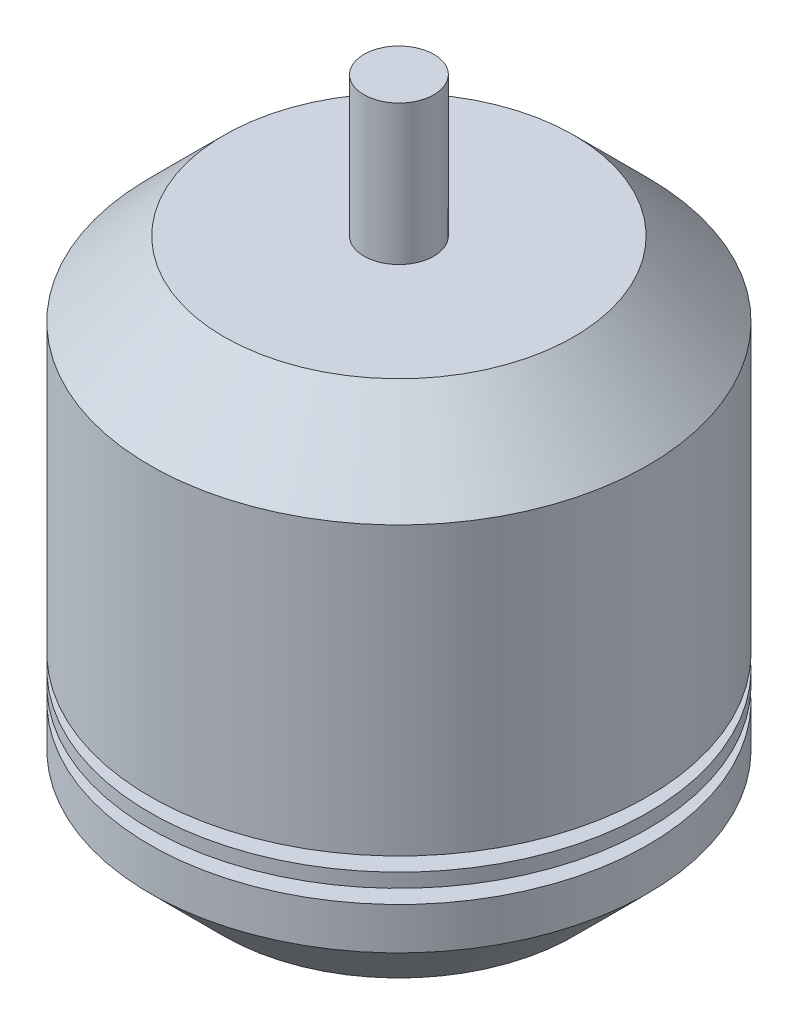
ISO-10303-21;
HEADER;
FILE_DESCRIPTION(('STEP AP214'),'2;1');
FILE_NAME('part.step','',(''),(''),'','','');
FILE_SCHEMA(('AUTOMOTIVE_DESIGN { 1 0 10303 214 1 1 1 1 }'));
ENDSEC;
DATA;
#1=APPLICATION_CONTEXT('core data for automotive mechanical design processes');
#2=APPLICATION_PROTOCOL_DEFINITION('international standard','automotive_design',2000,#1);
#3=PRODUCT_CONTEXT('',#1,'mechanical');
#4=PRODUCT('Part','Part','',(#3));
#5=PRODUCT_RELATED_PRODUCT_CATEGORY('part','',(#4));
#6=PRODUCT_DEFINITION_FORMATION('','',#4);
#7=PRODUCT_DEFINITION_CONTEXT('part definition',#1,'design');
#8=PRODUCT_DEFINITION('design','',#6,#7);
#9=PRODUCT_DEFINITION_SHAPE('','',#8);
#10=(LENGTH_UNIT() NAMED_UNIT(*) SI_UNIT(.MILLI.,.METRE.));
#11=(NAMED_UNIT(*) PLANE_ANGLE_UNIT() SI_UNIT($,.RADIAN.));
#12=(NAMED_UNIT(*) SI_UNIT($,.STERADIAN.) SOLID_ANGLE_UNIT());
#13=UNCERTAINTY_MEASURE_WITH_UNIT(LENGTH_MEASURE(1.E-05),#10,'distance_accuracy_value','');
#14=(GEOMETRIC_REPRESENTATION_CONTEXT(3) GLOBAL_UNCERTAINTY_ASSIGNED_CONTEXT((#13)) GLOBAL_UNIT_ASSIGNED_CONTEXT((#10,
#11,#12)) REPRESENTATION_CONTEXT('',''));
#15=CARTESIAN_POINT('',(0.,0.,0.));
#16=DIRECTION('',(0.,0.,1.));
#17=DIRECTION('',(1.,0.,0.));
#18=AXIS2_PLACEMENT_3D('',#15,#16,#17);
#19=CARTESIAN_POINT('',(0.,-25.4650148000843,0.));
#20=DIRECTION('',(0.,-1.,0.));
#21=DIRECTION('',(0.,0.,-1.));
#22=AXIS2_PLACEMENT_3D('',#19,#20,#21);
#23=PLANE('',#22);
#24=CARTESIAN_POINT('',(0.,-25.4650148000843,0.));
#25=DIRECTION('',(0.,-1.,0.));
#26=DIRECTION('',(0.,0.,-1.));
#27=AXIS2_PLACEMENT_3D('',#24,#25,#26);
#28=CIRCLE('',#27,6.35);
#29=CARTESIAN_POINT('',(0.,-25.4650148000843,-6.35));
#30=VERTEX_POINT('',#29);
#31=EDGE_CURVE('E10',#30,#30,#28,.T.);
#32=ORIENTED_EDGE('',*,*,#31,.T.);
#33=EDGE_LOOP('',(#32));
#34=FACE_BOUND('',#33,.T.);
#35=ADVANCED_FACE('F33',(#34),#23,.T.);
#36=CARTESIAN_POINT('',(0.,237.10577242447,0.));
#37=DIRECTION('',(0.,-1.,0.));
#38=DIRECTION('',(0.,0.,-1.));
#39=AXIS2_PLACEMENT_3D('',#36,#37,#38);
#40=CYLINDRICAL_SURFACE('',#39,6.35);
#41=CARTESIAN_POINT('',(0.,-2.19576430194546,0.));
#42=DIRECTION('',(0.,-1.,0.));
#43=DIRECTION('',(0.,0.,-1.));
#44=AXIS2_PLACEMENT_3D('',#41,#42,#43);
#45=CIRCLE('',#44,6.35);
#46=CARTESIAN_POINT('',(0.,-2.19576430194546,-6.35));
#47=VERTEX_POINT('',#46);
#48=EDGE_CURVE('E40',#47,#47,#45,.T.);
#49=ORIENTED_EDGE('',*,*,#48,.T.);
#50=EDGE_LOOP('',(#49));
#51=FACE_BOUND('',#50,.T.);
#52=ORIENTED_EDGE('',*,*,#31,.F.);
#53=EDGE_LOOP('',(#52));
#54=FACE_BOUND('',#53,.T.);
#55=ADVANCED_FACE('F213',(#51,#54),#40,.T.);
#56=CARTESIAN_POINT('',(6.35,-2.1957643019455,0.));
#57=DIRECTION('',(0.,-1.,0.));
#58=DIRECTION('',(0.,0.,-1.));
#59=AXIS2_PLACEMENT_3D('',#56,#57,#58);
#60=PLANE('',#59);
#61=CARTESIAN_POINT('',(0.,-2.19576430194554,0.));
#62=DIRECTION('',(0.,-1.,0.));
#63=DIRECTION('',(0.,0.,-1.));
#64=AXIS2_PLACEMENT_3D('',#61,#62,#63);
#65=CIRCLE('',#64,63.4999999999999);
#66=CARTESIAN_POINT('',(0.,-2.19576430194554,-63.4999999999999));
#67=VERTEX_POINT('',#66);
#68=EDGE_CURVE('E44',#67,#67,#65,.T.);
#69=ORIENTED_EDGE('',*,*,#68,.T.);
#70=EDGE_LOOP('',(#69));
#71=FACE_BOUND('',#70,.T.);
#72=ORIENTED_EDGE('',*,*,#48,.F.);
#73=EDGE_LOOP('',(#72));
#74=FACE_BOUND('',#73,.T.);
#75=ADVANCED_FACE('F210',(#71,#74),#60,.T.);
#76=CARTESIAN_POINT('',(0.,-2.19576430194554,0.));
#77=DIRECTION('',(0.,1.,0.));
#78=DIRECTION('',(0.,0.,1.));
#79=AXIS2_PLACEMENT_3D('',#76,#77,#78);
#80=CONICAL_SURFACE('',#79,63.4999999999999,0.785398163397446);
#81=CARTESIAN_POINT('',(0.,24.745004061262,0.));
#82=DIRECTION('',(0.,-1.,0.));
#83=DIRECTION('',(0.,0.,-1.));
#84=AXIS2_PLACEMENT_3D('',#81,#82,#83);
#85=CIRCLE('',#84,90.4407683632073);
#86=CARTESIAN_POINT('',(0.,24.745004061262,-90.4407683632073));
#87=VERTEX_POINT('',#86);
#88=EDGE_CURVE('E48',#87,#87,#85,.T.);
#89=ORIENTED_EDGE('',*,*,#88,.T.);
#90=EDGE_LOOP('',(#89));
#91=FACE_BOUND('',#90,.T.);
#92=ORIENTED_EDGE('',*,*,#68,.F.);
#93=EDGE_LOOP('',(#92));
#94=FACE_BOUND('',#93,.T.);
#95=ADVANCED_FACE('F206',(#91,#94),#80,.T.);
#96=CARTESIAN_POINT('',(0.,237.10577242447,0.));
#97=DIRECTION('',(0.,-1.,0.));
#98=DIRECTION('',(0.,0.,-1.));
#99=AXIS2_PLACEMENT_3D('',#96,#97,#98);
#100=CYLINDRICAL_SURFACE('',#99,90.4407683632073);
#101=CARTESIAN_POINT('',(0.,39.985004061262,0.));
#102=DIRECTION('',(0.,-1.,0.));
#103=DIRECTION('',(0.,0.,-1.));
#104=AXIS2_PLACEMENT_3D('',#101,#102,#103);
#105=CIRCLE('',#104,90.4407683632073);
#106=CARTESIAN_POINT('',(0.,39.985004061262,-90.4407683632073));
#107=VERTEX_POINT('',#106);
#108=EDGE_CURVE('E53',#107,#107,#105,.T.);
#109=ORIENTED_EDGE('',*,*,#108,.T.);
#110=EDGE_LOOP('',(#109));
#111=FACE_BOUND('',#110,.T.);
#112=ORIENTED_EDGE('',*,*,#88,.F.);
#113=EDGE_LOOP('',(#112));
#114=FACE_BOUND('',#113,.T.);
#115=ADVANCED_FACE('F202',(#111,#114),#100,.T.);
#116=CARTESIAN_POINT('',(80.2807683632074,39.985004061262,0.));
#117=DIRECTION('',(0.,1.,0.));
#118=DIRECTION('',(0.,0.,1.));
#119=AXIS2_PLACEMENT_3D('',#116,#117,#118);
#120=PLANE('',#119);
#121=CARTESIAN_POINT('',(0.,39.985004061262,0.));
#122=DIRECTION('',(0.,-1.,0.));
#123=DIRECTION('',(0.,0.,-1.));
#124=AXIS2_PLACEMENT_3D('',#121,#122,#123);
#125=CIRCLE('',#124,80.2807683632074);
#126=CARTESIAN_POINT('',(0.,39.985004061262,-80.2807683632074));
#127=VERTEX_POINT('',#126);
#128=EDGE_CURVE('E56',#127,#127,#125,.T.);
#129=ORIENTED_EDGE('',*,*,#128,.T.);
#130=EDGE_LOOP('',(#129));
#131=FACE_BOUND('',#130,.T.);
#132=ORIENTED_EDGE('',*,*,#108,.F.);
#133=EDGE_LOOP('',(#132));
#134=FACE_BOUND('',#133,.T.);
#135=ADVANCED_FACE('F198',(#131,#134),#120,.T.);
#136=CARTESIAN_POINT('',(0.,237.10577242447,0.));
#137=DIRECTION('',(0.,-1.,0.));
#138=DIRECTION('',(0.,0.,-1.));
#139=AXIS2_PLACEMENT_3D('',#136,#137,#138);
#140=CYLINDRICAL_SURFACE('',#139,80.2807683632074);
#141=CARTESIAN_POINT('',(0.,45.065004061262,0.));
#142=DIRECTION('',(0.,-1.,0.));
#143=DIRECTION('',(0.,0.,-1.));
#144=AXIS2_PLACEMENT_3D('',#141,#142,#143);
#145=CIRCLE('',#144,80.2807683632074);
#146=CARTESIAN_POINT('',(0.,45.065004061262,-80.2807683632074));
#147=VERTEX_POINT('',#146);
#148=EDGE_CURVE('E59',#147,#147,#145,.T.);
#149=ORIENTED_EDGE('',*,*,#148,.T.);
#150=EDGE_LOOP('',(#149));
#151=FACE_BOUND('',#150,.T.);
#152=ORIENTED_EDGE('',*,*,#128,.F.);
#153=EDGE_LOOP('',(#152));
#154=FACE_BOUND('',#153,.T.);
#155=ADVANCED_FACE('F194',(#151,#154),#140,.T.);
#156=CARTESIAN_POINT('',(90.4407683632073,45.065004061262,0.));
#157=DIRECTION('',(0.,-1.,0.));
#158=DIRECTION('',(0.,0.,-1.));
#159=AXIS2_PLACEMENT_3D('',#156,#157,#158);
#160=PLANE('',#159);
#161=CARTESIAN_POINT('',(0.,45.065004061262,0.));
#162=DIRECTION('',(0.,-1.,0.));
#163=DIRECTION('',(0.,0.,-1.));
#164=AXIS2_PLACEMENT_3D('',#161,#162,#163);
#165=CIRCLE('',#164,90.4407683632073);
#166=CARTESIAN_POINT('',(0.,45.065004061262,-90.4407683632073));
#167=VERTEX_POINT('',#166);
#168=EDGE_CURVE('E62',#167,#167,#165,.T.);
#169=ORIENTED_EDGE('',*,*,#168,.T.);
#170=EDGE_LOOP('',(#169));
#171=FACE_BOUND('',#170,.T.);
#172=ORIENTED_EDGE('',*,*,#148,.F.);
#173=EDGE_LOOP('',(#172));
#174=FACE_BOUND('',#173,.T.);
#175=ADVANCED_FACE('F190',(#171,#174),#160,.T.);
#176=CARTESIAN_POINT('',(0.,237.10577242447,0.));
#177=DIRECTION('',(0.,-1.,0.));
#178=DIRECTION('',(0.,0.,-1.));
#179=AXIS2_PLACEMENT_3D('',#176,#177,#178);
#180=CYLINDRICAL_SURFACE('',#179,90.4407683632073);
#181=CARTESIAN_POINT('',(0.,50.145004061262,0.));
#182=DIRECTION('',(0.,-1.,0.));
#183=DIRECTION('',(0.,0.,-1.));
#184=AXIS2_PLACEMENT_3D('',#181,#182,#183);
#185=CIRCLE('',#184,90.4407683632073);
#186=CARTESIAN_POINT('',(0.,50.145004061262,-90.4407683632073));
#187=VERTEX_POINT('',#186);
#188=EDGE_CURVE('E65',#187,#187,#185,.T.);
#189=ORIENTED_EDGE('',*,*,#188,.T.);
#190=EDGE_LOOP('',(#189));
#191=FACE_BOUND('',#190,.T.);
#192=ORIENTED_EDGE('',*,*,#168,.F.);
#193=EDGE_LOOP('',(#192));
#194=FACE_BOUND('',#193,.T.);
#195=ADVANCED_FACE('F186',(#191,#194),#180,.T.);
#196=CARTESIAN_POINT('',(80.2807683632073,50.145004061262,0.));
#197=DIRECTION('',(0.,1.,0.));
#198=DIRECTION('',(0.,0.,1.));
#199=AXIS2_PLACEMENT_3D('',#196,#197,#198);
#200=PLANE('',#199);
#201=CARTESIAN_POINT('',(0.,50.145004061262,0.));
#202=DIRECTION('',(0.,-1.,0.));
#203=DIRECTION('',(0.,0.,-1.));
#204=AXIS2_PLACEMENT_3D('',#201,#202,#203);
#205=CIRCLE('',#204,80.2807683632073);
#206=CARTESIAN_POINT('',(0.,50.145004061262,-80.2807683632073));
#207=VERTEX_POINT('',#206);
#208=EDGE_CURVE('E68',#207,#207,#205,.T.);
#209=ORIENTED_EDGE('',*,*,#208,.T.);
#210=EDGE_LOOP('',(#209));
#211=FACE_BOUND('',#210,.T.);
#212=ORIENTED_EDGE('',*,*,#188,.F.);
#213=EDGE_LOOP('',(#212));
#214=FACE_BOUND('',#213,.T.);
#215=ADVANCED_FACE('F182',(#211,#214),#200,.T.);
#216=CARTESIAN_POINT('',(0.,237.10577242447,0.));
#217=DIRECTION('',(0.,-1.,0.));
#218=DIRECTION('',(0.,0.,-1.));
#219=AXIS2_PLACEMENT_3D('',#216,#217,#218);
#220=CYLINDRICAL_SURFACE('',#219,80.2807683632073);
#221=CARTESIAN_POINT('',(0.,55.225004061262,0.));
#222=DIRECTION('',(0.,-1.,0.));
#223=DIRECTION('',(0.,0.,-1.));
#224=AXIS2_PLACEMENT_3D('',#221,#222,#223);
#225=CIRCLE('',#224,80.2807683632073);
#226=CARTESIAN_POINT('',(0.,55.225004061262,-80.2807683632073));
#227=VERTEX_POINT('',#226);
#228=EDGE_CURVE('E71',#227,#227,#225,.T.);
#229=ORIENTED_EDGE('',*,*,#228,.T.);
#230=EDGE_LOOP('',(#229));
#231=FACE_BOUND('',#230,.T.);
#232=ORIENTED_EDGE('',*,*,#208,.F.);
#233=EDGE_LOOP('',(#232));
#234=FACE_BOUND('',#233,.T.);
#235=ADVANCED_FACE('F178',(#231,#234),#220,.T.);
#236=CARTESIAN_POINT('',(90.4407683632073,55.225004061262,0.));
#237=DIRECTION('',(0.,-1.,0.));
#238=DIRECTION('',(0.,0.,-1.));
#239=AXIS2_PLACEMENT_3D('',#236,#237,#238);
#240=PLANE('',#239);
#241=CARTESIAN_POINT('',(0.,55.225004061262,0.));
#242=DIRECTION('',(0.,-1.,0.));
#243=DIRECTION('',(0.,0.,-1.));
#244=AXIS2_PLACEMENT_3D('',#241,#242,#243);
#245=CIRCLE('',#244,90.4407683632073);
#246=CARTESIAN_POINT('',(0.,55.225004061262,-90.4407683632073));
#247=VERTEX_POINT('',#246);
#248=EDGE_CURVE('E74',#247,#247,#245,.T.);
#249=ORIENTED_EDGE('',*,*,#248,.T.);
#250=EDGE_LOOP('',(#249));
#251=FACE_BOUND('',#250,.T.);
#252=ORIENTED_EDGE('',*,*,#228,.F.);
#253=EDGE_LOOP('',(#252));
#254=FACE_BOUND('',#253,.T.);
#255=ADVANCED_FACE('F174',(#251,#254),#240,.T.);
#256=CARTESIAN_POINT('',(0.,237.10577242447,0.));
#257=DIRECTION('',(0.,-1.,0.));
#258=DIRECTION('',(0.,0.,-1.));
#259=AXIS2_PLACEMENT_3D('',#256,#257,#258);
#260=CYLINDRICAL_SURFACE('',#259,90.4407683632068);
#261=CARTESIAN_POINT('',(0.,159.365004061261,0.));
#262=DIRECTION('',(0.,-1.,0.));
#263=DIRECTION('',(0.,0.,-1.));
#264=AXIS2_PLACEMENT_3D('',#261,#262,#263);
#265=CIRCLE('',#264,90.4407683632063);
#266=CARTESIAN_POINT('',(0.,159.365004061261,-90.4407683632063));
#267=VERTEX_POINT('',#266);
#268=EDGE_CURVE('E77',#267,#267,#265,.T.);
#269=ORIENTED_EDGE('',*,*,#268,.T.);
#270=EDGE_LOOP('',(#269));
#271=FACE_BOUND('',#270,.T.);
#272=ORIENTED_EDGE('',*,*,#248,.F.);
#273=EDGE_LOOP('',(#272));
#274=FACE_BOUND('',#273,.T.);
#275=ADVANCED_FACE('F170',(#271,#274),#260,.T.);
#276=CARTESIAN_POINT('',(0.,159.365004061261,0.));
#277=DIRECTION('',(0.,-1.,0.));
#278=DIRECTION('',(0.,0.,-1.));
#279=AXIS2_PLACEMENT_3D('',#276,#277,#278);
#280=CONICAL_SURFACE('',#279,90.4407683632063,0.785398163397406);
#281=CARTESIAN_POINT('',(0.,186.30577242447,0.));
#282=DIRECTION('',(0.,-1.,0.));
#283=DIRECTION('',(0.,0.,-1.));
#284=AXIS2_PLACEMENT_3D('',#281,#282,#283);
#285=CIRCLE('',#284,63.5);
#286=CARTESIAN_POINT('',(0.,186.30577242447,-63.5));
#287=VERTEX_POINT('',#286);
#288=EDGE_CURVE('E80',#287,#287,#285,.T.);
#289=ORIENTED_EDGE('',*,*,#288,.T.);
#290=EDGE_LOOP('',(#289));
#291=FACE_BOUND('',#290,.T.);
#292=ORIENTED_EDGE('',*,*,#268,.F.);
#293=EDGE_LOOP('',(#292));
#294=FACE_BOUND('',#293,.T.);
#295=ADVANCED_FACE('F166',(#291,#294),#280,.T.);
#296=CARTESIAN_POINT('',(63.5,186.30577242447,0.));
#297=DIRECTION('',(0.,1.,0.));
#298=DIRECTION('',(0.,0.,1.));
#299=AXIS2_PLACEMENT_3D('',#296,#297,#298);
#300=PLANE('',#299);
#301=CARTESIAN_POINT('',(0.,186.30577242447,0.));
#302=DIRECTION('',(0.,-1.,0.));
#303=DIRECTION('',(0.,0.,-1.));
#304=AXIS2_PLACEMENT_3D('',#301,#302,#303);
#305=CIRCLE('',#304,12.7);
#306=CARTESIAN_POINT('',(0.,186.30577242447,-12.7));
#307=VERTEX_POINT('',#306);
#308=EDGE_CURVE('E83',#307,#307,#305,.T.);
#309=ORIENTED_EDGE('',*,*,#308,.T.);
#310=EDGE_LOOP('',(#309));
#311=FACE_BOUND('',#310,.T.);
#312=ORIENTED_EDGE('',*,*,#288,.F.);
#313=EDGE_LOOP('',(#312));
#314=FACE_BOUND('',#313,.T.);
#315=ADVANCED_FACE('F162',(#311,#314),#300,.T.);
#316=CARTESIAN_POINT('',(0.,237.10577242447,0.));
#317=DIRECTION('',(0.,-1.,0.));
#318=DIRECTION('',(0.,0.,-1.));
#319=AXIS2_PLACEMENT_3D('',#316,#317,#318);
#320=CYLINDRICAL_SURFACE('',#319,12.7);
#321=CARTESIAN_POINT('',(0.,237.10577242447,0.));
#322=DIRECTION('',(0.,-1.,0.));
#323=DIRECTION('',(0.,0.,-1.));
#324=AXIS2_PLACEMENT_3D('',#321,#322,#323);
#325=CIRCLE('',#324,12.7);
#326=CARTESIAN_POINT('',(0.,237.10577242447,-12.7));
#327=VERTEX_POINT('',#326);
#328=EDGE_CURVE('E86',#327,#327,#325,.T.);
#329=ORIENTED_EDGE('',*,*,#328,.T.);
#330=EDGE_LOOP('',(#329));
#331=FACE_BOUND('',#330,.T.);
#332=ORIENTED_EDGE('',*,*,#308,.F.);
#333=EDGE_LOOP('',(#332));
#334=FACE_BOUND('',#333,.T.);
#335=ADVANCED_FACE('F158',(#331,#334),#320,.T.);
#336=CARTESIAN_POINT('',(12.7,237.10577242447,0.));
#337=DIRECTION('',(0.,1.,0.));
#338=DIRECTION('',(0.,0.,1.));
#339=AXIS2_PLACEMENT_3D('',#336,#337,#338);
#340=PLANE('',#339);
#341=ORIENTED_EDGE('',*,*,#328,.F.);
#342=EDGE_LOOP('',(#341));
#343=FACE_BOUND('',#342,.T.);
#344=ADVANCED_FACE('F155',(#343),#340,.T.);
#345=CLOSED_SHELL('',(#35,#55,#75,#95,#115,#135,#155,#175,#195,#215,#235,#255,#275,#295,#315,
#335,#344));
#346=CARTESIAN_POINT('',(0.,158.36577242447,0.));
#347=DIRECTION('',(0.,-1.,0.));
#348=DIRECTION('',(0.,0.,-1.));
#349=AXIS2_PLACEMENT_3D('',#346,#347,#348);
#350=CONICAL_SURFACE('',#349,80.2807683632073,0.785398163397446);
#351=CARTESIAN_POINT('',(0.,176.14577242447,0.));
#352=DIRECTION('',(0.,-1.,0.));
#353=DIRECTION('',(0.,0.,-1.));
#354=AXIS2_PLACEMENT_3D('',#351,#352,#353);
#355=CIRCLE('',#354,62.5007683632073);
#356=CARTESIAN_POINT('',(0.,176.14577242447,-62.5007683632073));
#357=VERTEX_POINT('',#356);
#358=EDGE_CURVE('E107',#357,#357,#355,.T.);
#359=ORIENTED_EDGE('',*,*,#358,.F.);
#360=EDGE_LOOP('',(#359));
#361=FACE_BOUND('',#360,.T.);
#362=CARTESIAN_POINT('',(0.,158.36577242447,0.));
#363=DIRECTION('',(0.,-1.,0.));
#364=DIRECTION('',(0.,0.,-1.));
#365=AXIS2_PLACEMENT_3D('',#362,#363,#364);
#366=CIRCLE('',#365,80.2807683632073);
#367=CARTESIAN_POINT('',(0.,158.36577242447,-80.2807683632073));
#368=VERTEX_POINT('',#367);
#369=EDGE_CURVE('E89',#368,#368,#366,.T.);
#370=ORIENTED_EDGE('',*,*,#369,.T.);
#371=EDGE_LOOP('',(#370));
#372=FACE_BOUND('',#371,.T.);
#373=ADVANCED_FACE('F113',(#361,#372),#350,.F.);
#374=CARTESIAN_POINT('',(0.,237.10577242447,0.));
#375=DIRECTION('',(0.,-1.,0.));
#376=DIRECTION('',(0.,0.,-1.));
#377=AXIS2_PLACEMENT_3D('',#374,#375,#376);
#378=CYLINDRICAL_SURFACE('',#377,80.2807683632073);
#379=ORIENTED_EDGE('',*,*,#369,.F.);
#380=EDGE_LOOP('',(#379));
#381=FACE_BOUND('',#380,.T.);
#382=CARTESIAN_POINT('',(0.,140.58577242447,0.));
#383=DIRECTION('',(0.,-1.,0.));
#384=DIRECTION('',(0.,0.,-1.));
#385=AXIS2_PLACEMENT_3D('',#382,#383,#384);
#386=CIRCLE('',#385,80.2807683632073);
#387=CARTESIAN_POINT('',(0.,140.58577242447,-80.2807683632073));
#388=VERTEX_POINT('',#387);
#389=EDGE_CURVE('E92',#388,#388,#386,.T.);
#390=ORIENTED_EDGE('',*,*,#389,.T.);
#391=EDGE_LOOP('',(#390));
#392=FACE_BOUND('',#391,.T.);
#393=ADVANCED_FACE('F116',(#381,#392),#378,.F.);
#394=CARTESIAN_POINT('',(80.2807683632073,140.58577242447,0.));
#395=DIRECTION('',(0.,-1.,0.));
#396=DIRECTION('',(0.,0.,-1.));
#397=AXIS2_PLACEMENT_3D('',#394,#395,#396);
#398=PLANE('',#397);
#399=ORIENTED_EDGE('',*,*,#389,.F.);
#400=EDGE_LOOP('',(#399));
#401=FACE_BOUND('',#400,.T.);
#402=CARTESIAN_POINT('',(0.,140.58577242447,0.));
#403=DIRECTION('',(0.,-1.,0.));
#404=DIRECTION('',(0.,0.,-1.));
#405=AXIS2_PLACEMENT_3D('',#402,#403,#404);
#406=CIRCLE('',#405,12.8072948156232);
#407=CARTESIAN_POINT('',(0.,140.58577242447,-12.8072948156232));
#408=VERTEX_POINT('',#407);
#409=EDGE_CURVE('E95',#408,#408,#406,.T.);
#410=ORIENTED_EDGE('',*,*,#409,.T.);
#411=EDGE_LOOP('',(#410));
#412=FACE_BOUND('',#411,.T.);
#413=ADVANCED_FACE('F123',(#401,#412),#398,.F.);
#414=CARTESIAN_POINT('',(0.,237.10577242447,0.));
#415=DIRECTION('',(0.,-1.,0.));
#416=DIRECTION('',(0.,0.,-1.));
#417=AXIS2_PLACEMENT_3D('',#414,#415,#416);
#418=CYLINDRICAL_SURFACE('',#417,12.8072948156232);
#419=ORIENTED_EDGE('',*,*,#409,.F.);
#420=EDGE_LOOP('',(#419));
#421=FACE_BOUND('',#420,.T.);
#422=CARTESIAN_POINT('',(0.,165.98577242447,0.));
#423=DIRECTION('',(0.,-1.,0.));
#424=DIRECTION('',(0.,0.,-1.));
#425=AXIS2_PLACEMENT_3D('',#422,#423,#424);
#426=CIRCLE('',#425,12.8072948156232);
#427=CARTESIAN_POINT('',(0.,165.98577242447,-12.8072948156232));
#428=VERTEX_POINT('',#427);
#429=EDGE_CURVE('E98',#428,#428,#426,.T.);
#430=ORIENTED_EDGE('',*,*,#429,.T.);
#431=EDGE_LOOP('',(#430));
#432=FACE_BOUND('',#431,.T.);
#433=ADVANCED_FACE('F129',(#421,#432),#418,.T.);
#434=CARTESIAN_POINT('',(12.8072948156232,165.98577242447,0.));
#435=DIRECTION('',(0.,1.,0.));
#436=DIRECTION('',(0.,0.,1.));
#437=AXIS2_PLACEMENT_3D('',#434,#435,#436);
#438=PLANE('',#437);
#439=ORIENTED_EDGE('',*,*,#429,.F.);
#440=EDGE_LOOP('',(#439));
#441=FACE_BOUND('',#440,.T.);
#442=CARTESIAN_POINT('',(0.,165.98577242447,0.));
#443=DIRECTION('',(0.,-1.,0.));
#444=DIRECTION('',(0.,0.,-1.));
#445=AXIS2_PLACEMENT_3D('',#442,#443,#444);
#446=CIRCLE('',#445,22.9672948156232);
#447=CARTESIAN_POINT('',(0.,165.98577242447,-22.9672948156232));
#448=VERTEX_POINT('',#447);
#449=EDGE_CURVE('E101',#448,#448,#446,.T.);
#450=ORIENTED_EDGE('',*,*,#449,.T.);
#451=EDGE_LOOP('',(#450));
#452=FACE_BOUND('',#451,.T.);
#453=ADVANCED_FACE('F135',(#441,#452),#438,.F.);
#454=CARTESIAN_POINT('',(0.,237.10577242447,0.));
#455=DIRECTION('',(0.,-1.,0.));
#456=DIRECTION('',(0.,0.,-1.));
#457=AXIS2_PLACEMENT_3D('',#454,#455,#456);
#458=CYLINDRICAL_SURFACE('',#457,22.9672948156232);
#459=ORIENTED_EDGE('',*,*,#449,.F.);
#460=EDGE_LOOP('',(#459));
#461=FACE_BOUND('',#460,.T.);
#462=CARTESIAN_POINT('',(0.,176.14577242447,0.));
#463=DIRECTION('',(0.,-1.,0.));
#464=DIRECTION('',(0.,0.,-1.));
#465=AXIS2_PLACEMENT_3D('',#462,#463,#464);
#466=CIRCLE('',#465,22.9672948156232);
#467=CARTESIAN_POINT('',(0.,176.14577242447,-22.9672948156232));
#468=VERTEX_POINT('',#467);
#469=EDGE_CURVE('E104',#468,#468,#466,.T.);
#470=ORIENTED_EDGE('',*,*,#469,.T.);
#471=EDGE_LOOP('',(#470));
#472=FACE_BOUND('',#471,.T.);
#473=ADVANCED_FACE('F141',(#461,#472),#458,.T.);
#474=CARTESIAN_POINT('',(22.9672948156232,176.14577242447,0.));
#475=DIRECTION('',(0.,1.,0.));
#476=DIRECTION('',(0.,0.,1.));
#477=AXIS2_PLACEMENT_3D('',#474,#475,#476);
#478=PLANE('',#477);
#479=ORIENTED_EDGE('',*,*,#469,.F.);
#480=EDGE_LOOP('',(#479));
#481=FACE_BOUND('',#480,.T.);
#482=ORIENTED_EDGE('',*,*,#358,.T.);
#483=EDGE_LOOP('',(#482));
#484=FACE_BOUND('',#483,.T.);
#485=ADVANCED_FACE('F111',(#481,#484),#478,.F.);
#486=CLOSED_SHELL('',(#373,#393,#413,#433,#453,#473,#485));
#487=ORIENTED_CLOSED_SHELL('',*,#486,.T.);
#488=BREP_WITH_VOIDS('B2',#345,(#487));
#489=ADVANCED_BREP_SHAPE_REPRESENTATION('',(#18,#488),#14);
#490=SHAPE_DEFINITION_REPRESENTATION(#9,#489);
ENDSEC;
END-ISO-10303-21;
